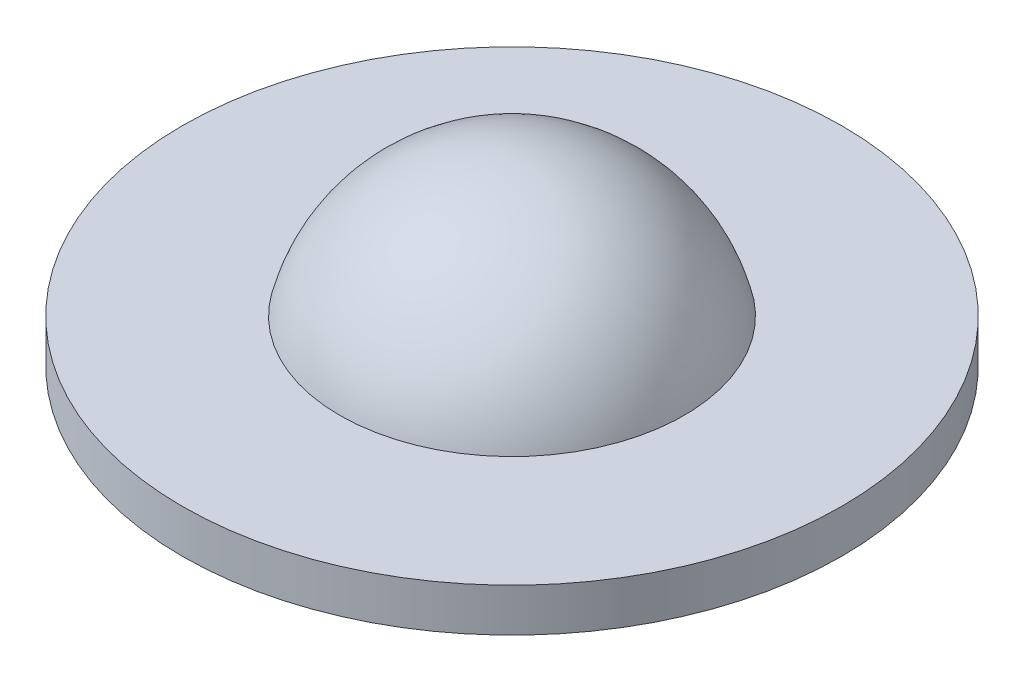
ISO-10303-21;
HEADER;
FILE_DESCRIPTION(('STEP AP214'),'2;1');
FILE_NAME('part.step','',(''),(''),'','','');
FILE_SCHEMA(('AUTOMOTIVE_DESIGN { 1 0 10303 214 1 1 1 1 }'));
ENDSEC;
DATA;
#1=APPLICATION_CONTEXT('core data for automotive mechanical design processes');
#2=APPLICATION_PROTOCOL_DEFINITION('international standard','automotive_design',2000,#1);
#3=PRODUCT_CONTEXT('',#1,'mechanical');
#4=PRODUCT('Part','Part','',(#3));
#5=PRODUCT_RELATED_PRODUCT_CATEGORY('part','',(#4));
#6=PRODUCT_DEFINITION_FORMATION('','',#4);
#7=PRODUCT_DEFINITION_CONTEXT('part definition',#1,'design');
#8=PRODUCT_DEFINITION('design','',#6,#7);
#9=PRODUCT_DEFINITION_SHAPE('','',#8);
#10=(LENGTH_UNIT() NAMED_UNIT(*) SI_UNIT(.MILLI.,.METRE.));
#11=(NAMED_UNIT(*) PLANE_ANGLE_UNIT() SI_UNIT($,.RADIAN.));
#12=(NAMED_UNIT(*) SI_UNIT($,.STERADIAN.) SOLID_ANGLE_UNIT());
#13=UNCERTAINTY_MEASURE_WITH_UNIT(LENGTH_MEASURE(1.E-05),#10,'distance_accuracy_value','');
#14=(GEOMETRIC_REPRESENTATION_CONTEXT(3) GLOBAL_UNCERTAINTY_ASSIGNED_CONTEXT((#13)) GLOBAL_UNIT_ASSIGNED_CONTEXT((#10,
#11,#12)) REPRESENTATION_CONTEXT('',''));
#15=CARTESIAN_POINT('',(0.,0.,0.));
#16=DIRECTION('',(0.,0.,1.));
#17=DIRECTION('',(1.,0.,0.));
#18=AXIS2_PLACEMENT_3D('',#15,#16,#17);
#19=CARTESIAN_POINT('',(0.,0.,0.));
#20=DIRECTION('',(0.,1.,0.));
#21=DIRECTION('',(0.,0.,1.));
#22=AXIS2_PLACEMENT_3D('',#19,#20,#21);
#23=SPHERICAL_SURFACE('',#22,7.9375);
#24=CARTESIAN_POINT('',(0.,-0.116756756756761,0.));
#25=DIRECTION('',(0.,1.,0.));
#26=DIRECTION('',(0.,0.,1.));
#27=AXIS2_PLACEMENT_3D('',#24,#25,#26);
#28=CIRCLE('',#27,7.9366412360489);
#29=CARTESIAN_POINT('',(0.,-0.116756756756759,7.93664123604889));
#30=VERTEX_POINT('',#29);
#31=EDGE_CURVE('E47',#30,#30,#28,.T.);
#32=ORIENTED_EDGE('',*,*,#31,.F.);
#33=EDGE_LOOP('',(#32));
#34=FACE_BOUND('',#33,.T.);
#35=ADVANCED_FACE('F33',(#34),#23,.T.);
#36=CARTESIAN_POINT('',(0.,0.,0.));
#37=DIRECTION('',(0.,1.,0.));
#38=DIRECTION('',(0.,0.,1.));
#39=AXIS2_PLACEMENT_3D('',#36,#37,#38);
#40=SPHERICAL_SURFACE('',#39,12.2812432432432);
#41=CARTESIAN_POINT('',(0.,2.88324324324324,0.));
#42=DIRECTION('',(0.,1.,0.));
#43=DIRECTION('',(0.,0.,1.));
#44=AXIS2_PLACEMENT_3D('',#41,#42,#43);
#45=CIRCLE('',#44,11.938);
#46=CARTESIAN_POINT('',(0.,2.88324324324324,11.938));
#47=VERTEX_POINT('',#46);
#48=EDGE_CURVE('E10',#47,#47,#45,.T.);
#49=ORIENTED_EDGE('',*,*,#48,.T.);
#50=EDGE_LOOP('',(#49));
#51=FACE_BOUND('',#50,.T.);
#52=ADVANCED_FACE('F57',(#51),#40,.T.);
#53=CARTESIAN_POINT('',(0.,2.88324324324324,22.86));
#54=DIRECTION('',(0.,1.,0.));
#55=DIRECTION('',(0.,0.,1.));
#56=AXIS2_PLACEMENT_3D('',#53,#54,#55);
#57=PLANE('',#56);
#58=CARTESIAN_POINT('',(0.,2.88324324324324,0.));
#59=DIRECTION('',(0.,1.,0.));
#60=DIRECTION('',(0.,0.,1.));
#61=AXIS2_PLACEMENT_3D('',#58,#59,#60);
#62=CIRCLE('',#61,22.86);
#63=CARTESIAN_POINT('',(0.,2.88324324324324,22.86));
#64=VERTEX_POINT('',#63);
#65=EDGE_CURVE('E39',#64,#64,#62,.T.);
#66=ORIENTED_EDGE('',*,*,#65,.T.);
#67=EDGE_LOOP('',(#66));
#68=FACE_BOUND('',#67,.T.);
#69=ORIENTED_EDGE('',*,*,#48,.F.);
#70=EDGE_LOOP('',(#69));
#71=FACE_BOUND('',#70,.T.);
#72=ADVANCED_FACE('F61',(#68,#71),#57,.T.);
#73=CARTESIAN_POINT('',(0.,-19.6570059732804,0.));
#74=DIRECTION('',(0.,1.,0.));
#75=DIRECTION('',(0.,0.,1.));
#76=AXIS2_PLACEMENT_3D('',#73,#74,#75);
#77=CYLINDRICAL_SURFACE('',#76,22.86);
#78=CARTESIAN_POINT('',(0.,-0.116756756756764,0.));
#79=DIRECTION('',(0.,1.,0.));
#80=DIRECTION('',(0.,0.,1.));
#81=AXIS2_PLACEMENT_3D('',#78,#79,#80);
#82=CIRCLE('',#81,22.86);
#83=CARTESIAN_POINT('',(0.,-0.116756756756761,22.86));
#84=VERTEX_POINT('',#83);
#85=EDGE_CURVE('E43',#84,#84,#82,.T.);
#86=ORIENTED_EDGE('',*,*,#85,.T.);
#87=EDGE_LOOP('',(#86));
#88=FACE_BOUND('',#87,.T.);
#89=ORIENTED_EDGE('',*,*,#65,.F.);
#90=EDGE_LOOP('',(#89));
#91=FACE_BOUND('',#90,.T.);
#92=ADVANCED_FACE('F65',(#88,#91),#77,.T.);
#93=CARTESIAN_POINT('',(0.,-0.116756756756762,7.93664123604889));
#94=DIRECTION('',(0.,-1.,0.));
#95=DIRECTION('',(0.,0.,-1.));
#96=AXIS2_PLACEMENT_3D('',#93,#94,#95);
#97=PLANE('',#96);
#98=ORIENTED_EDGE('',*,*,#31,.T.);
#99=EDGE_LOOP('',(#98));
#100=FACE_BOUND('',#99,.T.);
#101=ORIENTED_EDGE('',*,*,#85,.F.);
#102=EDGE_LOOP('',(#101));
#103=FACE_BOUND('',#102,.T.);
#104=ADVANCED_FACE('F53',(#100,#103),#97,.T.);
#105=CLOSED_SHELL('',(#35,#52,#72,#92,#104));
#106=MANIFOLD_SOLID_BREP('B2',#105);
#107=ADVANCED_BREP_SHAPE_REPRESENTATION('',(#18,#106),#14);
#108=SHAPE_DEFINITION_REPRESENTATION(#9,#107);
ENDSEC;
END-ISO-10303-21;
